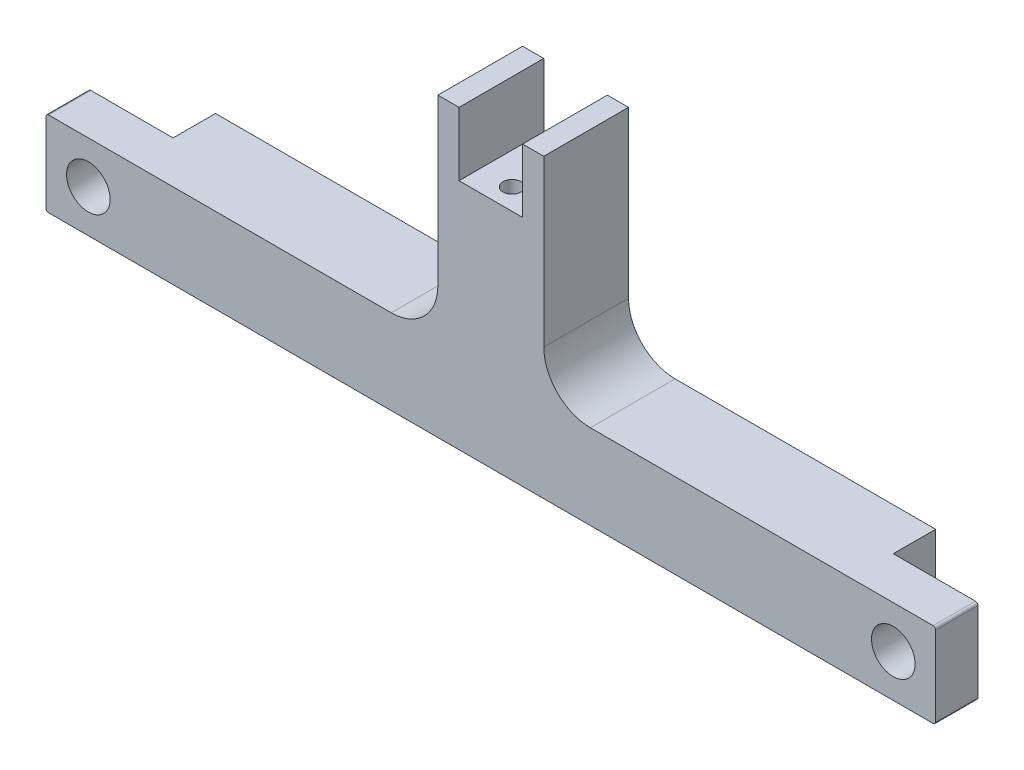
ISO-10303-21;
HEADER;
FILE_DESCRIPTION(('STEP AP214'),'2;1');
FILE_NAME('part.step','',(''),(''),'','','');
FILE_SCHEMA(('AUTOMOTIVE_DESIGN { 1 0 10303 214 1 1 1 1 }'));
ENDSEC;
DATA;
#1=APPLICATION_CONTEXT('core data for automotive mechanical design processes');
#2=APPLICATION_PROTOCOL_DEFINITION('international standard','automotive_design',2000,#1);
#3=PRODUCT_CONTEXT('',#1,'mechanical');
#4=PRODUCT('Part','Part','',(#3));
#5=PRODUCT_RELATED_PRODUCT_CATEGORY('part','',(#4));
#6=PRODUCT_DEFINITION_FORMATION('','',#4);
#7=PRODUCT_DEFINITION_CONTEXT('part definition',#1,'design');
#8=PRODUCT_DEFINITION('design','',#6,#7);
#9=PRODUCT_DEFINITION_SHAPE('','',#8);
#10=(LENGTH_UNIT() NAMED_UNIT(*) SI_UNIT(.MILLI.,.METRE.));
#11=(NAMED_UNIT(*) PLANE_ANGLE_UNIT() SI_UNIT($,.RADIAN.));
#12=(NAMED_UNIT(*) SI_UNIT($,.STERADIAN.) SOLID_ANGLE_UNIT());
#13=UNCERTAINTY_MEASURE_WITH_UNIT(LENGTH_MEASURE(1.E-05),#10,'distance_accuracy_value','');
#14=(GEOMETRIC_REPRESENTATION_CONTEXT(3) GLOBAL_UNCERTAINTY_ASSIGNED_CONTEXT((#13)) GLOBAL_UNIT_ASSIGNED_CONTEXT((#10,
#11,#12)) REPRESENTATION_CONTEXT('',''));
#15=CARTESIAN_POINT('',(0.,0.,0.));
#16=DIRECTION('',(0.,0.,1.));
#17=DIRECTION('',(1.,0.,0.));
#18=AXIS2_PLACEMENT_3D('',#15,#16,#17);
#19=CARTESIAN_POINT('',(-7.9375,38.1,12.7));
#20=DIRECTION('',(0.,-1.,0.));
#21=DIRECTION('',(0.,0.,-1.));
#22=AXIS2_PLACEMENT_3D('',#19,#20,#21);
#23=PLANE('',#22);
#24=DIRECTION('',(-1.,0.,0.));
#25=VECTOR('',#24,1.);
#26=CARTESIAN_POINT('',(-7.9375,38.1,12.7));
#27=LINE('',#26,#25);
#28=CARTESIAN_POINT('',(-4.7625,38.1,12.7));
#29=VERTEX_POINT('',#28);
#30=CARTESIAN_POINT('',(-7.9375,38.1,12.7));
#31=VERTEX_POINT('',#30);
#32=EDGE_CURVE('E335',#29,#31,#27,.T.);
#33=ORIENTED_EDGE('',*,*,#32,.F.);
#34=DIRECTION('',(0.,0.,1.));
#35=VECTOR('',#34,1.);
#36=CARTESIAN_POINT('',(-4.7625,38.1,12.7));
#37=LINE('',#36,#35);
#38=CARTESIAN_POINT('',(-4.7625,38.1,0.));
#39=VERTEX_POINT('',#38);
#40=EDGE_CURVE('E220',#39,#29,#37,.T.);
#41=ORIENTED_EDGE('',*,*,#40,.F.);
#42=DIRECTION('',(-1.,0.,0.));
#43=VECTOR('',#42,1.);
#44=CARTESIAN_POINT('',(-7.9375,38.1,0.));
#45=LINE('',#44,#43);
#46=CARTESIAN_POINT('',(-7.9375,38.1,0.));
#47=VERTEX_POINT('',#46);
#48=EDGE_CURVE('E376',#39,#47,#45,.T.);
#49=ORIENTED_EDGE('',*,*,#48,.T.);
#50=DIRECTION('',(0.,0.,-1.));
#51=VECTOR('',#50,1.);
#52=CARTESIAN_POINT('',(-7.9375,38.1,12.7));
#53=LINE('',#52,#51);
#54=EDGE_CURVE('E429',#31,#47,#53,.T.);
#55=ORIENTED_EDGE('',*,*,#54,.F.);
#56=EDGE_LOOP('',(#33,#41,#49,#55));
#57=FACE_BOUND('',#56,.T.);
#58=ADVANCED_FACE('F39',(#57),#23,.F.);
#59=CARTESIAN_POINT('',(66.294,5.969,12.7));
#60=DIRECTION('',(0.,0.,-1.));
#61=DIRECTION('',(-1.,0.,0.));
#62=AXIS2_PLACEMENT_3D('',#59,#60,#61);
#63=CYLINDRICAL_SURFACE('',#62,0.381000000000003);
#64=CARTESIAN_POINT('',(66.294,5.969,6.35));
#65=DIRECTION('',(0.,0.,-1.));
#66=DIRECTION('',(-1.,0.,0.));
#67=AXIS2_PLACEMENT_3D('',#64,#65,#66);
#68=CIRCLE('',#67,0.381000000000003);
#69=CARTESIAN_POINT('',(66.294,6.35,6.35));
#70=VERTEX_POINT('',#69);
#71=CARTESIAN_POINT('',(66.675,5.969,6.35));
#72=VERTEX_POINT('',#71);
#73=EDGE_CURVE('E303',#70,#72,#68,.T.);
#74=ORIENTED_EDGE('',*,*,#73,.F.);
#75=DIRECTION('',(0.,0.,-1.));
#76=VECTOR('',#75,1.);
#77=CARTESIAN_POINT('',(66.294,6.35,12.7));
#78=LINE('',#77,#76);
#79=CARTESIAN_POINT('',(66.294,6.35,12.7));
#80=VERTEX_POINT('',#79);
#81=EDGE_CURVE('E11',#80,#70,#78,.T.);
#82=ORIENTED_EDGE('',*,*,#81,.F.);
#83=CARTESIAN_POINT('',(66.294,5.969,12.7));
#84=DIRECTION('',(0.,0.,1.));
#85=DIRECTION('',(-1.,0.,0.));
#86=AXIS2_PLACEMENT_3D('',#83,#84,#85);
#87=CIRCLE('',#86,0.381000000000003);
#88=CARTESIAN_POINT('',(66.675,5.969,12.7));
#89=VERTEX_POINT('',#88);
#90=EDGE_CURVE('E321',#89,#80,#87,.T.);
#91=ORIENTED_EDGE('',*,*,#90,.F.);
#92=DIRECTION('',(0.,0.,-1.));
#93=VECTOR('',#92,1.);
#94=CARTESIAN_POINT('',(66.675,5.969,12.7));
#95=LINE('',#94,#93);
#96=EDGE_CURVE('E367',#89,#72,#95,.T.);
#97=ORIENTED_EDGE('',*,*,#96,.T.);
#98=EDGE_LOOP('',(#74,#82,#91,#97));
#99=FACE_BOUND('',#98,.T.);
#100=ADVANCED_FACE('F41',(#99),#63,.T.);
#101=CARTESIAN_POINT('',(-66.294,5.969,12.7));
#102=DIRECTION('',(0.,0.,-1.));
#103=DIRECTION('',(-1.,0.,0.));
#104=AXIS2_PLACEMENT_3D('',#101,#102,#103);
#105=CYLINDRICAL_SURFACE('',#104,0.381000000000003);
#106=CARTESIAN_POINT('',(-66.294,5.969,6.35));
#107=DIRECTION('',(0.,0.,-1.));
#108=DIRECTION('',(-1.,0.,0.));
#109=AXIS2_PLACEMENT_3D('',#106,#107,#108);
#110=CIRCLE('',#109,0.381000000000003);
#111=CARTESIAN_POINT('',(-66.675,5.969,6.35));
#112=VERTEX_POINT('',#111);
#113=CARTESIAN_POINT('',(-66.294,6.35,6.35));
#114=VERTEX_POINT('',#113);
#115=EDGE_CURVE('E309',#112,#114,#110,.T.);
#116=ORIENTED_EDGE('',*,*,#115,.F.);
#117=DIRECTION('',(0.,0.,-1.));
#118=VECTOR('',#117,1.);
#119=CARTESIAN_POINT('',(-66.675,5.969,12.7));
#120=LINE('',#119,#118);
#121=CARTESIAN_POINT('',(-66.675,5.969,12.7));
#122=VERTEX_POINT('',#121);
#123=EDGE_CURVE('E413',#122,#112,#120,.T.);
#124=ORIENTED_EDGE('',*,*,#123,.F.);
#125=CARTESIAN_POINT('',(-66.294,5.969,12.7));
#126=DIRECTION('',(0.,0.,1.));
#127=DIRECTION('',(-1.,0.,0.));
#128=AXIS2_PLACEMENT_3D('',#125,#126,#127);
#129=CIRCLE('',#128,0.381000000000003);
#130=CARTESIAN_POINT('',(-66.294,6.35,12.7));
#131=VERTEX_POINT('',#130);
#132=EDGE_CURVE('E349',#131,#122,#129,.T.);
#133=ORIENTED_EDGE('',*,*,#132,.F.);
#134=DIRECTION('',(0.,0.,-1.));
#135=VECTOR('',#134,1.);
#136=CARTESIAN_POINT('',(-66.294,6.35,12.7));
#137=LINE('',#136,#135);
#138=EDGE_CURVE('E417',#131,#114,#137,.T.);
#139=ORIENTED_EDGE('',*,*,#138,.T.);
#140=EDGE_LOOP('',(#116,#124,#133,#139));
#141=FACE_BOUND('',#140,.T.);
#142=ADVANCED_FACE('F539',(#141),#105,.T.);
#143=CARTESIAN_POINT('',(-66.675,-5.969,12.7));
#144=DIRECTION('',(1.,0.,0.));
#145=DIRECTION('',(0.,0.,-1.));
#146=AXIS2_PLACEMENT_3D('',#143,#144,#145);
#147=PLANE('',#146);
#148=DIRECTION('',(0.,1.,0.));
#149=VECTOR('',#148,1.);
#150=CARTESIAN_POINT('',(-66.675,-6.35000000000001,6.35));
#151=LINE('',#150,#149);
#152=CARTESIAN_POINT('',(-66.675,-5.969,6.35));
#153=VERTEX_POINT('',#152);
#154=EDGE_CURVE('E281',#153,#112,#151,.T.);
#155=ORIENTED_EDGE('',*,*,#154,.F.);
#156=DIRECTION('',(0.,0.,-1.));
#157=VECTOR('',#156,1.);
#158=CARTESIAN_POINT('',(-66.675,-5.969,12.7));
#159=LINE('',#158,#157);
#160=CARTESIAN_POINT('',(-66.675,-5.969,12.7));
#161=VERTEX_POINT('',#160);
#162=EDGE_CURVE('E409',#161,#153,#159,.T.);
#163=ORIENTED_EDGE('',*,*,#162,.F.);
#164=DIRECTION('',(0.,-1.,0.));
#165=VECTOR('',#164,1.);
#166=CARTESIAN_POINT('',(-66.675,-5.969,12.7));
#167=LINE('',#166,#165);
#168=EDGE_CURVE('E352',#122,#161,#167,.T.);
#169=ORIENTED_EDGE('',*,*,#168,.F.);
#170=ORIENTED_EDGE('',*,*,#123,.T.);
#171=EDGE_LOOP('',(#155,#163,#169,#170));
#172=FACE_BOUND('',#171,.T.);
#173=ADVANCED_FACE('F556',(#172),#147,.F.);
#174=CARTESIAN_POINT('',(-66.294,-5.969,12.7));
#175=DIRECTION('',(0.,0.,-1.));
#176=DIRECTION('',(-1.,0.,0.));
#177=AXIS2_PLACEMENT_3D('',#174,#175,#176);
#178=CYLINDRICAL_SURFACE('',#177,0.381000000000003);
#179=CARTESIAN_POINT('',(-66.294,-5.969,6.35));
#180=DIRECTION('',(0.,0.,-1.));
#181=DIRECTION('',(-1.,0.,0.));
#182=AXIS2_PLACEMENT_3D('',#179,#180,#181);
#183=CIRCLE('',#182,0.381000000000003);
#184=CARTESIAN_POINT('',(-66.294,-6.35000000000001,6.35));
#185=VERTEX_POINT('',#184);
#186=EDGE_CURVE('E306',#185,#153,#183,.T.);
#187=ORIENTED_EDGE('',*,*,#186,.F.);
#188=DIRECTION('',(0.,0.,-1.));
#189=VECTOR('',#188,1.);
#190=CARTESIAN_POINT('',(-66.294,-6.35,12.7));
#191=LINE('',#190,#189);
#192=CARTESIAN_POINT('',(-66.294,-6.35,12.7));
#193=VERTEX_POINT('',#192);
#194=EDGE_CURVE('E405',#193,#185,#191,.T.);
#195=ORIENTED_EDGE('',*,*,#194,.F.);
#196=CARTESIAN_POINT('',(-66.294,-5.969,12.7));
#197=DIRECTION('',(0.,0.,1.));
#198=DIRECTION('',(-1.,0.,0.));
#199=AXIS2_PLACEMENT_3D('',#196,#197,#198);
#200=CIRCLE('',#199,0.381000000000003);
#201=EDGE_CURVE('E355',#161,#193,#200,.T.);
#202=ORIENTED_EDGE('',*,*,#201,.F.);
#203=ORIENTED_EDGE('',*,*,#162,.T.);
#204=EDGE_LOOP('',(#187,#195,#202,#203));
#205=FACE_BOUND('',#204,.T.);
#206=ADVANCED_FACE('F553',(#205),#178,.T.);
#207=CARTESIAN_POINT('',(66.294,-5.969,12.7));
#208=DIRECTION('',(0.,0.,-1.));
#209=DIRECTION('',(-1.,0.,0.));
#210=AXIS2_PLACEMENT_3D('',#207,#208,#209);
#211=CYLINDRICAL_SURFACE('',#210,0.381000000000003);
#212=CARTESIAN_POINT('',(66.294,-5.969,6.35));
#213=DIRECTION('',(0.,0.,-1.));
#214=DIRECTION('',(-1.,0.,0.));
#215=AXIS2_PLACEMENT_3D('',#212,#213,#214);
#216=CIRCLE('',#215,0.381000000000003);
#217=CARTESIAN_POINT('',(66.675,-5.969,6.35));
#218=VERTEX_POINT('',#217);
#219=CARTESIAN_POINT('',(66.294,-6.35,6.35));
#220=VERTEX_POINT('',#219);
#221=EDGE_CURVE('E300',#218,#220,#216,.T.);
#222=ORIENTED_EDGE('',*,*,#221,.F.);
#223=DIRECTION('',(0.,0.,-1.));
#224=VECTOR('',#223,1.);
#225=CARTESIAN_POINT('',(66.675,-5.969,12.7));
#226=LINE('',#225,#224);
#227=CARTESIAN_POINT('',(66.675,-5.969,12.7));
#228=VERTEX_POINT('',#227);
#229=EDGE_CURVE('E397',#228,#218,#226,.T.);
#230=ORIENTED_EDGE('',*,*,#229,.F.);
#231=CARTESIAN_POINT('',(66.294,-5.969,12.7));
#232=DIRECTION('',(0.,0.,1.));
#233=DIRECTION('',(1.,0.,0.));
#234=AXIS2_PLACEMENT_3D('',#231,#232,#233);
#235=CIRCLE('',#234,0.381000000000003);
#236=CARTESIAN_POINT('',(66.294,-6.35,12.7));
#237=VERTEX_POINT('',#236);
#238=EDGE_CURVE('E361',#237,#228,#235,.T.);
#239=ORIENTED_EDGE('',*,*,#238,.F.);
#240=DIRECTION('',(0.,0.,-1.));
#241=VECTOR('',#240,1.);
#242=CARTESIAN_POINT('',(66.294,-6.35,12.7));
#243=LINE('',#242,#241);
#244=EDGE_CURVE('E401',#237,#220,#243,.T.);
#245=ORIENTED_EDGE('',*,*,#244,.T.);
#246=EDGE_LOOP('',(#222,#230,#239,#245));
#247=FACE_BOUND('',#246,.T.);
#248=ADVANCED_FACE('F476',(#247),#211,.T.);
#249=CARTESIAN_POINT('',(66.675,-5.969,12.7));
#250=DIRECTION('',(-1.,0.,0.));
#251=DIRECTION('',(0.,0.,1.));
#252=AXIS2_PLACEMENT_3D('',#249,#250,#251);
#253=PLANE('',#252);
#254=DIRECTION('',(0.,-1.,0.));
#255=VECTOR('',#254,1.);
#256=CARTESIAN_POINT('',(66.675,6.35,6.35));
#257=LINE('',#256,#255);
#258=EDGE_CURVE('E256',#72,#218,#257,.T.);
#259=ORIENTED_EDGE('',*,*,#258,.F.);
#260=ORIENTED_EDGE('',*,*,#96,.F.);
#261=DIRECTION('',(0.,1.,0.));
#262=VECTOR('',#261,1.);
#263=CARTESIAN_POINT('',(66.675,-5.969,12.7));
#264=LINE('',#263,#262);
#265=EDGE_CURVE('E364',#228,#89,#264,.T.);
#266=ORIENTED_EDGE('',*,*,#265,.F.);
#267=ORIENTED_EDGE('',*,*,#229,.T.);
#268=EDGE_LOOP('',(#259,#260,#266,#267));
#269=FACE_BOUND('',#268,.T.);
#270=ADVANCED_FACE('F463',(#269),#253,.F.);
#271=CARTESIAN_POINT('',(-60.325,0.,12.7));
#272=DIRECTION('',(0.,0.,-1.));
#273=DIRECTION('',(-1.,0.,0.));
#274=AXIS2_PLACEMENT_3D('',#271,#272,#273);
#275=CYLINDRICAL_SURFACE('',#274,3.2639);
#276=CARTESIAN_POINT('',(-60.325,0.,12.7));
#277=DIRECTION('',(0.,0.,1.));
#278=DIRECTION('',(1.,0.,0.));
#279=AXIS2_PLACEMENT_3D('',#276,#277,#278);
#280=CIRCLE('',#279,3.2639);
#281=CARTESIAN_POINT('',(-57.0611,0.,12.7));
#282=VERTEX_POINT('',#281);
#283=EDGE_CURVE('E316',#282,#282,#280,.T.);
#284=ORIENTED_EDGE('',*,*,#283,.T.);
#285=EDGE_LOOP('',(#284));
#286=FACE_BOUND('',#285,.T.);
#287=CARTESIAN_POINT('',(-60.325,0.,6.35));
#288=DIRECTION('',(0.,0.,-1.));
#289=DIRECTION('',(-1.,0.,0.));
#290=AXIS2_PLACEMENT_3D('',#287,#288,#289);
#291=CIRCLE('',#290,3.2639);
#292=CARTESIAN_POINT('',(-63.5889,0.,6.35));
#293=VERTEX_POINT('',#292);
#294=EDGE_CURVE('E43',#293,#293,#291,.T.);
#295=ORIENTED_EDGE('',*,*,#294,.T.);
#296=EDGE_LOOP('',(#295));
#297=FACE_BOUND('',#296,.T.);
#298=ADVANCED_FACE('F522',(#286,#297),#275,.F.);
#299=CARTESIAN_POINT('',(60.325,0.,12.7));
#300=DIRECTION('',(0.,0.,-1.));
#301=DIRECTION('',(-1.,0.,0.));
#302=AXIS2_PLACEMENT_3D('',#299,#300,#301);
#303=CYLINDRICAL_SURFACE('',#302,3.26389999999999);
#304=CARTESIAN_POINT('',(60.325,0.,12.7));
#305=DIRECTION('',(0.,0.,1.));
#306=DIRECTION('',(1.,0.,0.));
#307=AXIS2_PLACEMENT_3D('',#304,#305,#306);
#308=CIRCLE('',#307,3.26389999999999);
#309=CARTESIAN_POINT('',(63.5889,0.,12.7));
#310=VERTEX_POINT('',#309);
#311=EDGE_CURVE('E312',#310,#310,#308,.T.);
#312=ORIENTED_EDGE('',*,*,#311,.T.);
#313=EDGE_LOOP('',(#312));
#314=FACE_BOUND('',#313,.T.);
#315=CARTESIAN_POINT('',(60.325,0.,6.35));
#316=DIRECTION('',(0.,0.,-1.));
#317=DIRECTION('',(-1.,0.,0.));
#318=AXIS2_PLACEMENT_3D('',#315,#316,#317);
#319=CIRCLE('',#318,3.26389999999999);
#320=CARTESIAN_POINT('',(57.0611,0.,6.35));
#321=VERTEX_POINT('',#320);
#322=EDGE_CURVE('E278',#321,#321,#319,.T.);
#323=ORIENTED_EDGE('',*,*,#322,.T.);
#324=EDGE_LOOP('',(#323));
#325=FACE_BOUND('',#324,.T.);
#326=ADVANCED_FACE('F447',(#314,#325),#303,.F.);
#327=CARTESIAN_POINT('',(66.294,5.969,12.7));
#328=DIRECTION('',(0.,0.,-1.));
#329=DIRECTION('',(-1.,0.,0.));
#330=AXIS2_PLACEMENT_3D('',#327,#328,#329);
#331=PLANE('',#330);
#332=DIRECTION('',(1.,0.,0.));
#333=VECTOR('',#332,1.);
#334=CARTESIAN_POINT('',(-4.7625,28.575,12.7));
#335=LINE('',#334,#333);
#336=CARTESIAN_POINT('',(-4.7625,28.575,12.7));
#337=VERTEX_POINT('',#336);
#338=CARTESIAN_POINT('',(4.7625,28.575,12.7));
#339=VERTEX_POINT('',#338);
#340=EDGE_CURVE('E225',#337,#339,#335,.T.);
#341=ORIENTED_EDGE('',*,*,#340,.F.);
#342=DIRECTION('',(0.,1.,0.));
#343=VECTOR('',#342,1.);
#344=CARTESIAN_POINT('',(-4.7625,28.575,12.7));
#345=LINE('',#344,#343);
#346=EDGE_CURVE('E238',#337,#29,#345,.T.);
#347=ORIENTED_EDGE('',*,*,#346,.T.);
#348=ORIENTED_EDGE('',*,*,#32,.T.);
#349=DIRECTION('',(0.,-1.,0.));
#350=VECTOR('',#349,1.);
#351=CARTESIAN_POINT('',(-7.9375,13.335,12.7));
#352=LINE('',#351,#350);
#353=CARTESIAN_POINT('',(-7.9375,13.335,12.7));
#354=VERTEX_POINT('',#353);
#355=EDGE_CURVE('E340',#31,#354,#352,.T.);
#356=ORIENTED_EDGE('',*,*,#355,.T.);
#357=CARTESIAN_POINT('',(-14.9225,13.335,12.7));
#358=DIRECTION('',(0.,0.,-1.));
#359=DIRECTION('',(-1.,0.,0.));
#360=AXIS2_PLACEMENT_3D('',#357,#358,#359);
#361=CIRCLE('',#360,6.985);
#362=CARTESIAN_POINT('',(-14.9225000000001,6.35,12.7));
#363=VERTEX_POINT('',#362);
#364=EDGE_CURVE('E343',#354,#363,#361,.T.);
#365=ORIENTED_EDGE('',*,*,#364,.T.);
#366=DIRECTION('',(-1.,0.,0.));
#367=VECTOR('',#366,1.);
#368=CARTESIAN_POINT('',(-66.294,6.35,12.7));
#369=LINE('',#368,#367);
#370=EDGE_CURVE('E346',#363,#131,#369,.T.);
#371=ORIENTED_EDGE('',*,*,#370,.T.);
#372=ORIENTED_EDGE('',*,*,#132,.T.);
#373=ORIENTED_EDGE('',*,*,#168,.T.);
#374=ORIENTED_EDGE('',*,*,#201,.T.);
#375=DIRECTION('',(1.,0.,0.));
#376=VECTOR('',#375,1.);
#377=CARTESIAN_POINT('',(-66.294,-6.35,12.7));
#378=LINE('',#377,#376);
#379=EDGE_CURVE('E358',#193,#237,#378,.T.);
#380=ORIENTED_EDGE('',*,*,#379,.T.);
#381=ORIENTED_EDGE('',*,*,#238,.T.);
#382=ORIENTED_EDGE('',*,*,#265,.T.);
#383=ORIENTED_EDGE('',*,*,#90,.T.);
#384=DIRECTION('',(-1.,0.,0.));
#385=VECTOR('',#384,1.);
#386=CARTESIAN_POINT('',(14.9225000000001,6.35,12.7));
#387=LINE('',#386,#385);
#388=CARTESIAN_POINT('',(14.9225000000001,6.35,12.7));
#389=VERTEX_POINT('',#388);
#390=EDGE_CURVE('E325',#80,#389,#387,.T.);
#391=ORIENTED_EDGE('',*,*,#390,.T.);
#392=CARTESIAN_POINT('',(14.9225,13.335,12.7));
#393=DIRECTION('',(0.,0.,-1.));
#394=DIRECTION('',(1.,0.,0.));
#395=AXIS2_PLACEMENT_3D('',#392,#393,#394);
#396=CIRCLE('',#395,6.985);
#397=CARTESIAN_POINT('',(7.9375,13.3350000000001,12.7));
#398=VERTEX_POINT('',#397);
#399=EDGE_CURVE('E329',#389,#398,#396,.T.);
#400=ORIENTED_EDGE('',*,*,#399,.T.);
#401=DIRECTION('',(0.,1.,0.));
#402=VECTOR('',#401,1.);
#403=CARTESIAN_POINT('',(7.9375,38.1,12.7));
#404=LINE('',#403,#402);
#405=CARTESIAN_POINT('',(7.9375,38.1,12.7));
#406=VERTEX_POINT('',#405);
#407=EDGE_CURVE('E332',#398,#406,#404,.T.);
#408=ORIENTED_EDGE('',*,*,#407,.T.);
#409=CARTESIAN_POINT('',(4.7625,38.1,12.7));
#410=VERTEX_POINT('',#409);
#411=EDGE_CURVE('E336',#406,#410,#27,.T.);
#412=ORIENTED_EDGE('',*,*,#411,.T.);
#413=DIRECTION('',(0.,1.,0.));
#414=VECTOR('',#413,1.);
#415=CARTESIAN_POINT('',(4.7625,28.575,12.7));
#416=LINE('',#415,#414);
#417=EDGE_CURVE('E57',#339,#410,#416,.T.);
#418=ORIENTED_EDGE('',*,*,#417,.F.);
#419=EDGE_LOOP('',(#341,#347,#348,#356,#365,#371,#372,#373,#374,#380,#381,#382,#383,#391,#400,
#408,#412,#418));
#420=FACE_BOUND('',#419,.T.);
#421=ORIENTED_EDGE('',*,*,#283,.F.);
#422=EDGE_LOOP('',(#421));
#423=FACE_BOUND('',#422,.T.);
#424=ORIENTED_EDGE('',*,*,#311,.F.);
#425=EDGE_LOOP('',(#424));
#426=FACE_BOUND('',#425,.T.);
#427=ADVANCED_FACE('F469',(#420,#423,#426),#331,.F.);
#428=CARTESIAN_POINT('',(66.294,5.969,0.));
#429=DIRECTION('',(0.,0.,-1.));
#430=DIRECTION('',(-1.,0.,0.));
#431=AXIS2_PLACEMENT_3D('',#428,#429,#430);
#432=PLANE('',#431);
#433=DIRECTION('',(0.,1.,0.));
#434=VECTOR('',#433,1.);
#435=CARTESIAN_POINT('',(-4.7625,28.575,0.));
#436=LINE('',#435,#434);
#437=CARTESIAN_POINT('',(-4.7625,28.575,0.));
#438=VERTEX_POINT('',#437);
#439=EDGE_CURVE('E243',#438,#39,#436,.T.);
#440=ORIENTED_EDGE('',*,*,#439,.F.);
#441=DIRECTION('',(-1.,0.,0.));
#442=VECTOR('',#441,1.);
#443=CARTESIAN_POINT('',(-4.7625,28.575,0.));
#444=LINE('',#443,#442);
#445=CARTESIAN_POINT('',(4.7625,28.575,0.));
#446=VERTEX_POINT('',#445);
#447=EDGE_CURVE('E234',#446,#438,#444,.T.);
#448=ORIENTED_EDGE('',*,*,#447,.F.);
#449=DIRECTION('',(0.,1.,0.));
#450=VECTOR('',#449,1.);
#451=CARTESIAN_POINT('',(4.7625,28.575,0.));
#452=LINE('',#451,#450);
#453=CARTESIAN_POINT('',(4.7625,38.1,0.));
#454=VERTEX_POINT('',#453);
#455=EDGE_CURVE('E247',#446,#454,#452,.T.);
#456=ORIENTED_EDGE('',*,*,#455,.T.);
#457=CARTESIAN_POINT('',(7.9375,38.1,0.));
#458=VERTEX_POINT('',#457);
#459=EDGE_CURVE('E377',#458,#454,#45,.T.);
#460=ORIENTED_EDGE('',*,*,#459,.F.);
#461=DIRECTION('',(0.,1.,0.));
#462=VECTOR('',#461,1.);
#463=CARTESIAN_POINT('',(7.9375,38.1,0.));
#464=LINE('',#463,#462);
#465=CARTESIAN_POINT('',(7.9375,13.3350000000001,0.));
#466=VERTEX_POINT('',#465);
#467=EDGE_CURVE('E373',#466,#458,#464,.T.);
#468=ORIENTED_EDGE('',*,*,#467,.F.);
#469=CARTESIAN_POINT('',(14.9225,13.335,0.));
#470=DIRECTION('',(0.,0.,-1.));
#471=DIRECTION('',(1.,0.,0.));
#472=AXIS2_PLACEMENT_3D('',#469,#470,#471);
#473=CIRCLE('',#472,6.985);
#474=CARTESIAN_POINT('',(14.9225000000001,6.35,0.));
#475=VERTEX_POINT('',#474);
#476=EDGE_CURVE('E370',#475,#466,#473,.T.);
#477=ORIENTED_EDGE('',*,*,#476,.F.);
#478=DIRECTION('',(-1.,0.,0.));
#479=VECTOR('',#478,1.);
#480=CARTESIAN_POINT('',(14.9225000000001,6.35,0.));
#481=LINE('',#480,#479);
#482=CARTESIAN_POINT('',(53.975,6.35,0.));
#483=VERTEX_POINT('',#482);
#484=EDGE_CURVE('E320',#483,#475,#481,.T.);
#485=ORIENTED_EDGE('',*,*,#484,.F.);
#486=DIRECTION('',(0.,1.,0.));
#487=VECTOR('',#486,1.);
#488=CARTESIAN_POINT('',(53.975,6.35,0.));
#489=LINE('',#488,#487);
#490=CARTESIAN_POINT('',(53.975,-6.35,0.));
#491=VERTEX_POINT('',#490);
#492=EDGE_CURVE('E260',#491,#483,#489,.T.);
#493=ORIENTED_EDGE('',*,*,#492,.F.);
#494=DIRECTION('',(1.,0.,0.));
#495=VECTOR('',#494,1.);
#496=CARTESIAN_POINT('',(-66.294,-6.35,0.));
#497=LINE('',#496,#495);
#498=CARTESIAN_POINT('',(-53.975,-6.35000000000001,0.));
#499=VERTEX_POINT('',#498);
#500=EDGE_CURVE('E326',#499,#491,#497,.T.);
#501=ORIENTED_EDGE('',*,*,#500,.F.);
#502=DIRECTION('',(0.,-1.,0.));
#503=VECTOR('',#502,1.);
#504=CARTESIAN_POINT('',(-53.975,-6.35000000000001,0.));
#505=LINE('',#504,#503);
#506=CARTESIAN_POINT('',(-53.975,6.35,0.));
#507=VERTEX_POINT('',#506);
#508=EDGE_CURVE('E246',#507,#499,#505,.T.);
#509=ORIENTED_EDGE('',*,*,#508,.F.);
#510=DIRECTION('',(-1.,0.,0.));
#511=VECTOR('',#510,1.);
#512=CARTESIAN_POINT('',(-66.294,6.35,0.));
#513=LINE('',#512,#511);
#514=CARTESIAN_POINT('',(-14.9225000000001,6.35,0.));
#515=VERTEX_POINT('',#514);
#516=EDGE_CURVE('E387',#515,#507,#513,.T.);
#517=ORIENTED_EDGE('',*,*,#516,.F.);
#518=CARTESIAN_POINT('',(-14.9225,13.335,0.));
#519=DIRECTION('',(0.,0.,-1.));
#520=DIRECTION('',(-1.,0.,0.));
#521=AXIS2_PLACEMENT_3D('',#518,#519,#520);
#522=CIRCLE('',#521,6.985);
#523=CARTESIAN_POINT('',(-7.9375,13.335,0.));
#524=VERTEX_POINT('',#523);
#525=EDGE_CURVE('E384',#524,#515,#522,.T.);
#526=ORIENTED_EDGE('',*,*,#525,.F.);
#527=DIRECTION('',(0.,-1.,0.));
#528=VECTOR('',#527,1.);
#529=CARTESIAN_POINT('',(-7.9375,13.335,0.));
#530=LINE('',#529,#528);
#531=EDGE_CURVE('E381',#47,#524,#530,.T.);
#532=ORIENTED_EDGE('',*,*,#531,.F.);
#533=ORIENTED_EDGE('',*,*,#48,.F.);
#534=EDGE_LOOP('',(#440,#448,#456,#460,#468,#477,#485,#493,#501,#509,#517,#526,#532,#533));
#535=FACE_BOUND('',#534,.T.);
#536=ADVANCED_FACE('F487',(#535),#432,.T.);
#537=CARTESIAN_POINT('',(14.9225000000001,6.35,12.7));
#538=DIRECTION('',(0.,-1.,0.));
#539=DIRECTION('',(1.,0.,0.));
#540=AXIS2_PLACEMENT_3D('',#537,#538,#539);
#541=PLANE('',#540);
#542=DIRECTION('',(1.,0.,0.));
#543=VECTOR('',#542,1.);
#544=CARTESIAN_POINT('',(66.675,6.35,6.35));
#545=LINE('',#544,#543);
#546=CARTESIAN_POINT('',(53.975,6.35,6.35));
#547=VERTEX_POINT('',#546);
#548=EDGE_CURVE('E267',#547,#70,#545,.T.);
#549=ORIENTED_EDGE('',*,*,#548,.F.);
#550=DIRECTION('',(0.,0.,-1.));
#551=VECTOR('',#550,1.);
#552=CARTESIAN_POINT('',(53.975,6.35,6.35));
#553=LINE('',#552,#551);
#554=EDGE_CURVE('E274',#547,#483,#553,.T.);
#555=ORIENTED_EDGE('',*,*,#554,.T.);
#556=ORIENTED_EDGE('',*,*,#484,.T.);
#557=DIRECTION('',(0.,0.,-1.));
#558=VECTOR('',#557,1.);
#559=CARTESIAN_POINT('',(14.9225000000001,6.35,12.7));
#560=LINE('',#559,#558);
#561=EDGE_CURVE('E49',#389,#475,#560,.T.);
#562=ORIENTED_EDGE('',*,*,#561,.F.);
#563=ORIENTED_EDGE('',*,*,#390,.F.);
#564=ORIENTED_EDGE('',*,*,#81,.T.);
#565=EDGE_LOOP('',(#549,#555,#556,#562,#563,#564));
#566=FACE_BOUND('',#565,.T.);
#567=ADVANCED_FACE('F492',(#566),#541,.F.);
#568=CARTESIAN_POINT('',(14.9225,13.335,12.7));
#569=DIRECTION('',(0.,0.,-1.));
#570=DIRECTION('',(-1.,0.,0.));
#571=AXIS2_PLACEMENT_3D('',#568,#569,#570);
#572=CYLINDRICAL_SURFACE('',#571,6.985);
#573=ORIENTED_EDGE('',*,*,#476,.T.);
#574=DIRECTION('',(0.,0.,-1.));
#575=VECTOR('',#574,1.);
#576=CARTESIAN_POINT('',(7.9375,13.3350000000001,12.7));
#577=LINE('',#576,#575);
#578=EDGE_CURVE('E437',#398,#466,#577,.T.);
#579=ORIENTED_EDGE('',*,*,#578,.F.);
#580=ORIENTED_EDGE('',*,*,#399,.F.);
#581=ORIENTED_EDGE('',*,*,#561,.T.);
#582=EDGE_LOOP('',(#573,#579,#580,#581));
#583=FACE_BOUND('',#582,.T.);
#584=ADVANCED_FACE('F495',(#583),#572,.F.);
#585=CARTESIAN_POINT('',(7.9375,38.1,12.7));
#586=DIRECTION('',(-1.,0.,0.));
#587=DIRECTION('',(0.,-1.,0.));
#588=AXIS2_PLACEMENT_3D('',#585,#586,#587);
#589=PLANE('',#588);
#590=ORIENTED_EDGE('',*,*,#467,.T.);
#591=DIRECTION('',(0.,0.,-1.));
#592=VECTOR('',#591,1.);
#593=CARTESIAN_POINT('',(7.9375,38.1,12.7));
#594=LINE('',#593,#592);
#595=EDGE_CURVE('E433',#406,#458,#594,.T.);
#596=ORIENTED_EDGE('',*,*,#595,.F.);
#597=ORIENTED_EDGE('',*,*,#407,.F.);
#598=ORIENTED_EDGE('',*,*,#578,.T.);
#599=EDGE_LOOP('',(#590,#596,#597,#598));
#600=FACE_BOUND('',#599,.T.);
#601=ADVANCED_FACE('F501',(#600),#589,.F.);
#602=ORIENTED_EDGE('',*,*,#459,.T.);
#603=DIRECTION('',(0.,0.,-1.));
#604=VECTOR('',#603,1.);
#605=CARTESIAN_POINT('',(4.7625,38.1,12.7));
#606=LINE('',#605,#604);
#607=EDGE_CURVE('E226',#410,#454,#606,.T.);
#608=ORIENTED_EDGE('',*,*,#607,.F.);
#609=ORIENTED_EDGE('',*,*,#411,.F.);
#610=ORIENTED_EDGE('',*,*,#595,.T.);
#611=EDGE_LOOP('',(#602,#608,#609,#610));
#612=FACE_BOUND('',#611,.T.);
#613=ADVANCED_FACE('F504',(#612),#23,.F.);
#614=CARTESIAN_POINT('',(-7.9375,13.335,12.7));
#615=DIRECTION('',(1.,0.,0.));
#616=DIRECTION('',(0.,0.,-1.));
#617=AXIS2_PLACEMENT_3D('',#614,#615,#616);
#618=PLANE('',#617);
#619=ORIENTED_EDGE('',*,*,#531,.T.);
#620=DIRECTION('',(0.,0.,-1.));
#621=VECTOR('',#620,1.);
#622=CARTESIAN_POINT('',(-7.9375,13.335,12.7));
#623=LINE('',#622,#621);
#624=EDGE_CURVE('E425',#354,#524,#623,.T.);
#625=ORIENTED_EDGE('',*,*,#624,.F.);
#626=ORIENTED_EDGE('',*,*,#355,.F.);
#627=ORIENTED_EDGE('',*,*,#54,.T.);
#628=EDGE_LOOP('',(#619,#625,#626,#627));
#629=FACE_BOUND('',#628,.T.);
#630=ADVANCED_FACE('F573',(#629),#618,.F.);
#631=CARTESIAN_POINT('',(-14.9225,13.335,12.7));
#632=DIRECTION('',(0.,0.,-1.));
#633=DIRECTION('',(-1.,0.,0.));
#634=AXIS2_PLACEMENT_3D('',#631,#632,#633);
#635=CYLINDRICAL_SURFACE('',#634,6.985);
#636=ORIENTED_EDGE('',*,*,#525,.T.);
#637=DIRECTION('',(0.,0.,-1.));
#638=VECTOR('',#637,1.);
#639=CARTESIAN_POINT('',(-14.9225000000001,6.35,12.7));
#640=LINE('',#639,#638);
#641=EDGE_CURVE('E421',#363,#515,#640,.T.);
#642=ORIENTED_EDGE('',*,*,#641,.F.);
#643=ORIENTED_EDGE('',*,*,#364,.F.);
#644=ORIENTED_EDGE('',*,*,#624,.T.);
#645=EDGE_LOOP('',(#636,#642,#643,#644));
#646=FACE_BOUND('',#645,.T.);
#647=ADVANCED_FACE('F578',(#646),#635,.F.);
#648=CARTESIAN_POINT('',(-66.294,6.35,12.7));
#649=DIRECTION('',(0.,-1.,0.));
#650=DIRECTION('',(0.,0.,-1.));
#651=AXIS2_PLACEMENT_3D('',#648,#649,#650);
#652=PLANE('',#651);
#653=ORIENTED_EDGE('',*,*,#516,.T.);
#654=DIRECTION('',(0.,0.,-1.));
#655=VECTOR('',#654,1.);
#656=CARTESIAN_POINT('',(-53.975,6.35,6.35));
#657=LINE('',#656,#655);
#658=CARTESIAN_POINT('',(-53.975,6.35,6.35));
#659=VERTEX_POINT('',#658);
#660=EDGE_CURVE('E292',#659,#507,#657,.T.);
#661=ORIENTED_EDGE('',*,*,#660,.F.);
#662=DIRECTION('',(1.,0.,0.));
#663=VECTOR('',#662,1.);
#664=CARTESIAN_POINT('',(-66.675,6.35,6.35));
#665=LINE('',#664,#663);
#666=EDGE_CURVE('E284',#114,#659,#665,.T.);
#667=ORIENTED_EDGE('',*,*,#666,.F.);
#668=ORIENTED_EDGE('',*,*,#138,.F.);
#669=ORIENTED_EDGE('',*,*,#370,.F.);
#670=ORIENTED_EDGE('',*,*,#641,.T.);
#671=EDGE_LOOP('',(#653,#661,#667,#668,#669,#670));
#672=FACE_BOUND('',#671,.T.);
#673=ADVANCED_FACE('F536',(#672),#652,.F.);
#674=CARTESIAN_POINT('',(-66.294,-6.35,12.7));
#675=DIRECTION('',(0.,1.,0.));
#676=DIRECTION('',(0.,0.,1.));
#677=AXIS2_PLACEMENT_3D('',#674,#675,#676);
#678=PLANE('',#677);
#679=ORIENTED_EDGE('',*,*,#500,.T.);
#680=DIRECTION('',(0.,0.,-1.));
#681=VECTOR('',#680,1.);
#682=CARTESIAN_POINT('',(53.975,-6.35,6.35));
#683=LINE('',#682,#681);
#684=CARTESIAN_POINT('',(53.975,-6.35,6.35));
#685=VERTEX_POINT('',#684);
#686=EDGE_CURVE('E270',#685,#491,#683,.T.);
#687=ORIENTED_EDGE('',*,*,#686,.F.);
#688=DIRECTION('',(-1.,0.,0.));
#689=VECTOR('',#688,1.);
#690=CARTESIAN_POINT('',(66.675,-6.35,6.35));
#691=LINE('',#690,#689);
#692=EDGE_CURVE('E259',#220,#685,#691,.T.);
#693=ORIENTED_EDGE('',*,*,#692,.F.);
#694=ORIENTED_EDGE('',*,*,#244,.F.);
#695=ORIENTED_EDGE('',*,*,#379,.F.);
#696=ORIENTED_EDGE('',*,*,#194,.T.);
#697=DIRECTION('',(-1.,0.,0.));
#698=VECTOR('',#697,1.);
#699=CARTESIAN_POINT('',(-66.675,-6.35000000000001,6.35));
#700=LINE('',#699,#698);
#701=CARTESIAN_POINT('',(-53.975,-6.35,6.35));
#702=VERTEX_POINT('',#701);
#703=EDGE_CURVE('E289',#702,#185,#700,.T.);
#704=ORIENTED_EDGE('',*,*,#703,.F.);
#705=DIRECTION('',(0.,0.,-1.));
#706=VECTOR('',#705,1.);
#707=CARTESIAN_POINT('',(-53.975,-6.35000000000001,6.35));
#708=LINE('',#707,#706);
#709=EDGE_CURVE('E273',#702,#499,#708,.T.);
#710=ORIENTED_EDGE('',*,*,#709,.T.);
#711=EDGE_LOOP('',(#679,#687,#693,#694,#695,#696,#704,#710));
#712=FACE_BOUND('',#711,.T.);
#713=ADVANCED_FACE('F453',(#712),#678,.F.);
#714=CARTESIAN_POINT('',(0.,0.,6.35));
#715=DIRECTION('',(0.,0.,-1.));
#716=DIRECTION('',(-1.,0.,0.));
#717=AXIS2_PLACEMENT_3D('',#714,#715,#716);
#718=PLANE('',#717);
#719=ORIENTED_EDGE('',*,*,#322,.F.);
#720=EDGE_LOOP('',(#719));
#721=FACE_BOUND('',#720,.T.);
#722=ORIENTED_EDGE('',*,*,#73,.T.);
#723=ORIENTED_EDGE('',*,*,#258,.T.);
#724=ORIENTED_EDGE('',*,*,#221,.T.);
#725=ORIENTED_EDGE('',*,*,#692,.T.);
#726=DIRECTION('',(0.,1.,0.));
#727=VECTOR('',#726,1.);
#728=CARTESIAN_POINT('',(53.975,6.35,6.35));
#729=LINE('',#728,#727);
#730=EDGE_CURVE('E263',#685,#547,#729,.T.);
#731=ORIENTED_EDGE('',*,*,#730,.T.);
#732=ORIENTED_EDGE('',*,*,#548,.T.);
#733=EDGE_LOOP('',(#722,#723,#724,#725,#731,#732));
#734=FACE_BOUND('',#733,.T.);
#735=ADVANCED_FACE('F449',(#721,#734),#718,.T.);
#736=CARTESIAN_POINT('',(53.975,6.35,6.35));
#737=DIRECTION('',(-1.,0.,0.));
#738=DIRECTION('',(0.,0.,1.));
#739=AXIS2_PLACEMENT_3D('',#736,#737,#738);
#740=PLANE('',#739);
#741=ORIENTED_EDGE('',*,*,#492,.T.);
#742=ORIENTED_EDGE('',*,*,#554,.F.);
#743=ORIENTED_EDGE('',*,*,#730,.F.);
#744=ORIENTED_EDGE('',*,*,#686,.T.);
#745=EDGE_LOOP('',(#741,#742,#743,#744));
#746=FACE_BOUND('',#745,.T.);
#747=ADVANCED_FACE('F452',(#746),#740,.F.);
#748=CARTESIAN_POINT('',(0.,0.,6.35));
#749=DIRECTION('',(0.,0.,-1.));
#750=DIRECTION('',(-1.,0.,0.));
#751=AXIS2_PLACEMENT_3D('',#748,#749,#750);
#752=PLANE('',#751);
#753=ORIENTED_EDGE('',*,*,#294,.F.);
#754=EDGE_LOOP('',(#753));
#755=FACE_BOUND('',#754,.T.);
#756=ORIENTED_EDGE('',*,*,#115,.T.);
#757=ORIENTED_EDGE('',*,*,#666,.T.);
#758=DIRECTION('',(0.,-1.,0.));
#759=VECTOR('',#758,1.);
#760=CARTESIAN_POINT('',(-53.975,-6.35000000000001,6.35));
#761=LINE('',#760,#759);
#762=EDGE_CURVE('E65',#659,#702,#761,.T.);
#763=ORIENTED_EDGE('',*,*,#762,.T.);
#764=ORIENTED_EDGE('',*,*,#703,.T.);
#765=ORIENTED_EDGE('',*,*,#186,.T.);
#766=ORIENTED_EDGE('',*,*,#154,.T.);
#767=EDGE_LOOP('',(#756,#757,#763,#764,#765,#766));
#768=FACE_BOUND('',#767,.T.);
#769=ADVANCED_FACE('F524',(#755,#768),#752,.T.);
#770=CARTESIAN_POINT('',(-53.975,-6.35000000000001,6.35));
#771=DIRECTION('',(1.,0.,0.));
#772=DIRECTION('',(0.,0.,-1.));
#773=AXIS2_PLACEMENT_3D('',#770,#771,#772);
#774=PLANE('',#773);
#775=ORIENTED_EDGE('',*,*,#508,.T.);
#776=ORIENTED_EDGE('',*,*,#709,.F.);
#777=ORIENTED_EDGE('',*,*,#762,.F.);
#778=ORIENTED_EDGE('',*,*,#660,.T.);
#779=EDGE_LOOP('',(#775,#776,#777,#778));
#780=FACE_BOUND('',#779,.T.);
#781=ADVANCED_FACE('F526',(#780),#774,.F.);
#782=CARTESIAN_POINT('',(-4.7625,28.575,12.7));
#783=DIRECTION('',(-1.,0.,0.));
#784=DIRECTION('',(0.,0.,1.));
#785=AXIS2_PLACEMENT_3D('',#782,#783,#784);
#786=PLANE('',#785);
#787=ORIENTED_EDGE('',*,*,#40,.T.);
#788=ORIENTED_EDGE('',*,*,#346,.F.);
#789=DIRECTION('',(0.,0.,1.));
#790=VECTOR('',#789,1.);
#791=CARTESIAN_POINT('',(-4.7625,28.575,12.7));
#792=LINE('',#791,#790);
#793=EDGE_CURVE('E221',#438,#337,#792,.T.);
#794=ORIENTED_EDGE('',*,*,#793,.F.);
#795=ORIENTED_EDGE('',*,*,#439,.T.);
#796=EDGE_LOOP('',(#787,#788,#794,#795));
#797=FACE_BOUND('',#796,.T.);
#798=ADVANCED_FACE('F657',(#797),#786,.F.);
#799=CARTESIAN_POINT('',(4.7625,28.575,12.7));
#800=DIRECTION('',(1.,0.,0.));
#801=DIRECTION('',(0.,0.,-1.));
#802=AXIS2_PLACEMENT_3D('',#799,#800,#801);
#803=PLANE('',#802);
#804=ORIENTED_EDGE('',*,*,#607,.T.);
#805=ORIENTED_EDGE('',*,*,#455,.F.);
#806=DIRECTION('',(0.,0.,-1.));
#807=VECTOR('',#806,1.);
#808=CARTESIAN_POINT('',(4.7625,28.575,12.7));
#809=LINE('',#808,#807);
#810=EDGE_CURVE('E230',#339,#446,#809,.T.);
#811=ORIENTED_EDGE('',*,*,#810,.F.);
#812=ORIENTED_EDGE('',*,*,#417,.T.);
#813=EDGE_LOOP('',(#804,#805,#811,#812));
#814=FACE_BOUND('',#813,.T.);
#815=ADVANCED_FACE('F505',(#814),#803,.F.);
#816=CARTESIAN_POINT('',(0.,28.575,0.));
#817=DIRECTION('',(0.,-1.,0.));
#818=DIRECTION('',(0.,0.,-1.));
#819=AXIS2_PLACEMENT_3D('',#816,#817,#818);
#820=PLANE('',#819);
#821=CARTESIAN_POINT('',(0.,28.575,3.175));
#822=DIRECTION('',(0.,1.,0.));
#823=DIRECTION('',(0.,0.,1.));
#824=AXIS2_PLACEMENT_3D('',#821,#822,#823);
#825=CIRCLE('',#824,1.35254999999999);
#826=CARTESIAN_POINT('',(0.,28.575,4.52754999999999));
#827=VERTEX_POINT('',#826);
#828=EDGE_CURVE('E207',#827,#827,#825,.T.);
#829=ORIENTED_EDGE('',*,*,#828,.F.);
#830=EDGE_LOOP('',(#829));
#831=FACE_BOUND('',#830,.T.);
#832=CARTESIAN_POINT('',(0.,28.575,9.525));
#833=DIRECTION('',(0.,1.,0.));
#834=DIRECTION('',(0.,0.,1.));
#835=AXIS2_PLACEMENT_3D('',#832,#833,#834);
#836=CIRCLE('',#835,1.35254999999999);
#837=CARTESIAN_POINT('',(0.,28.575,10.87755));
#838=VERTEX_POINT('',#837);
#839=EDGE_CURVE('E206',#838,#838,#836,.T.);
#840=ORIENTED_EDGE('',*,*,#839,.F.);
#841=EDGE_LOOP('',(#840));
#842=FACE_BOUND('',#841,.T.);
#843=ORIENTED_EDGE('',*,*,#793,.T.);
#844=ORIENTED_EDGE('',*,*,#340,.T.);
#845=ORIENTED_EDGE('',*,*,#810,.T.);
#846=ORIENTED_EDGE('',*,*,#447,.T.);
#847=EDGE_LOOP('',(#843,#844,#845,#846));
#848=FACE_BOUND('',#847,.T.);
#849=ADVANCED_FACE('F509',(#831,#842,#848),#820,.F.);
#850=CARTESIAN_POINT('',(0.,12.7,9.525));
#851=DIRECTION('',(0.,1.,0.));
#852=DIRECTION('',(0.,0.,1.));
#853=AXIS2_PLACEMENT_3D('',#850,#851,#852);
#854=CONICAL_SURFACE('',#853,1.35255,1.02974425867665);
#855=CARTESIAN_POINT('',(0.,11.8873059697343,9.525));
#856=VERTEX_POINT('',#855);
#857=VERTEX_LOOP('',#856);
#858=FACE_BOUND('',#857,.T.);
#859=CARTESIAN_POINT('',(0.,12.7,9.525));
#860=DIRECTION('',(0.,1.,0.));
#861=DIRECTION('',(0.,0.,1.));
#862=AXIS2_PLACEMENT_3D('',#859,#860,#861);
#863=CIRCLE('',#862,1.35255);
#864=CARTESIAN_POINT('',(0.,12.7,10.87755));
#865=VERTEX_POINT('',#864);
#866=EDGE_CURVE('E212',#865,#865,#863,.T.);
#867=ORIENTED_EDGE('',*,*,#866,.T.);
#868=EDGE_LOOP('',(#867));
#869=FACE_BOUND('',#868,.T.);
#870=ADVANCED_FACE('F746',(#858,#869),#854,.F.);
#871=CARTESIAN_POINT('',(0.,28.575,9.525));
#872=DIRECTION('',(0.,1.,0.));
#873=DIRECTION('',(0.,0.,1.));
#874=AXIS2_PLACEMENT_3D('',#871,#872,#873);
#875=CYLINDRICAL_SURFACE('',#874,1.35254999999999);
#876=ORIENTED_EDGE('',*,*,#866,.F.);
#877=EDGE_LOOP('',(#876));
#878=FACE_BOUND('',#877,.T.);
#879=ORIENTED_EDGE('',*,*,#839,.T.);
#880=EDGE_LOOP('',(#879));
#881=FACE_BOUND('',#880,.T.);
#882=ADVANCED_FACE('F199',(#878,#881),#875,.F.);
#883=CARTESIAN_POINT('',(0.,12.7,3.175));
#884=DIRECTION('',(0.,1.,0.));
#885=DIRECTION('',(0.,0.,1.));
#886=AXIS2_PLACEMENT_3D('',#883,#884,#885);
#887=CONICAL_SURFACE('',#886,1.35255,1.02974425867665);
#888=CARTESIAN_POINT('',(0.,11.8873059697343,3.175));
#889=VERTEX_POINT('',#888);
#890=VERTEX_LOOP('',#889);
#891=FACE_BOUND('',#890,.T.);
#892=CARTESIAN_POINT('',(0.,12.7,3.175));
#893=DIRECTION('',(0.,1.,0.));
#894=DIRECTION('',(0.,0.,1.));
#895=AXIS2_PLACEMENT_3D('',#892,#893,#894);
#896=CIRCLE('',#895,1.35255);
#897=CARTESIAN_POINT('',(0.,12.7,4.52755));
#898=VERTEX_POINT('',#897);
#899=EDGE_CURVE('E203',#898,#898,#896,.T.);
#900=ORIENTED_EDGE('',*,*,#899,.T.);
#901=EDGE_LOOP('',(#900));
#902=FACE_BOUND('',#901,.T.);
#903=ADVANCED_FACE('F195',(#891,#902),#887,.F.);
#904=CARTESIAN_POINT('',(0.,28.575,3.175));
#905=DIRECTION('',(0.,1.,0.));
#906=DIRECTION('',(0.,0.,1.));
#907=AXIS2_PLACEMENT_3D('',#904,#905,#906);
#908=CYLINDRICAL_SURFACE('',#907,1.35254999999999);
#909=ORIENTED_EDGE('',*,*,#899,.F.);
#910=EDGE_LOOP('',(#909));
#911=FACE_BOUND('',#910,.T.);
#912=ORIENTED_EDGE('',*,*,#828,.T.);
#913=EDGE_LOOP('',(#912));
#914=FACE_BOUND('',#913,.T.);
#915=ADVANCED_FACE('F198',(#911,#914),#908,.F.);
#916=CLOSED_SHELL('',(#58,#100,#142,#173,#206,#248,#270,#298,#326,#427,#536,#567,#584,#601,#613,
#630,#647,#673,#713,#735,#747,#769,#781,#798,#815,#849,#870,#882,#903,#915));
#917=MANIFOLD_SOLID_BREP('B2',#916);
#918=ADVANCED_BREP_SHAPE_REPRESENTATION('',(#18,#917),#14);
#919=SHAPE_DEFINITION_REPRESENTATION(#9,#918);
ENDSEC;
END-ISO-10303-21;
